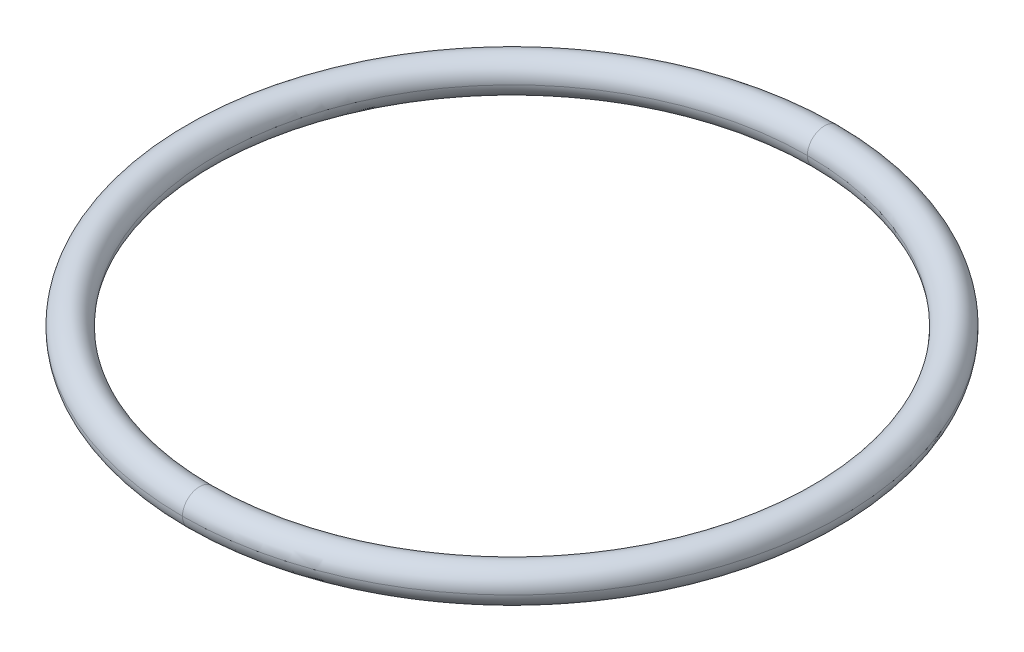
ISO-10303-21;
HEADER;
FILE_DESCRIPTION(('STEP AP214'),'2;1');
FILE_NAME('part.step','',(''),(''),'','','');
FILE_SCHEMA(('AUTOMOTIVE_DESIGN { 1 0 10303 214 1 1 1 1 }'));
ENDSEC;
DATA;
#1=APPLICATION_CONTEXT('core data for automotive mechanical design processes');
#2=APPLICATION_PROTOCOL_DEFINITION('international standard','automotive_design',2000,#1);
#3=PRODUCT_CONTEXT('',#1,'mechanical');
#4=PRODUCT('Part','Part','',(#3));
#5=PRODUCT_RELATED_PRODUCT_CATEGORY('part','',(#4));
#6=PRODUCT_DEFINITION_FORMATION('','',#4);
#7=PRODUCT_DEFINITION_CONTEXT('part definition',#1,'design');
#8=PRODUCT_DEFINITION('design','',#6,#7);
#9=PRODUCT_DEFINITION_SHAPE('','',#8);
#10=(LENGTH_UNIT() NAMED_UNIT(*) SI_UNIT(.MILLI.,.METRE.));
#11=(NAMED_UNIT(*) PLANE_ANGLE_UNIT() SI_UNIT($,.RADIAN.));
#12=(NAMED_UNIT(*) SI_UNIT($,.STERADIAN.) SOLID_ANGLE_UNIT());
#13=UNCERTAINTY_MEASURE_WITH_UNIT(LENGTH_MEASURE(1.E-05),#10,'distance_accuracy_value','');
#14=(GEOMETRIC_REPRESENTATION_CONTEXT(3) GLOBAL_UNCERTAINTY_ASSIGNED_CONTEXT((#13)) GLOBAL_UNIT_ASSIGNED_CONTEXT((#10,
#11,#12)) REPRESENTATION_CONTEXT('',''));
#15=CARTESIAN_POINT('',(0.,0.,0.));
#16=DIRECTION('',(0.,0.,1.));
#17=DIRECTION('',(1.,0.,0.));
#18=AXIS2_PLACEMENT_3D('',#15,#16,#17);
#19=CARTESIAN_POINT('',(0.,0.,0.));
#20=DIRECTION('',(0.,-1.,0.));
#21=DIRECTION('',(0.,0.,-1.));
#22=AXIS2_PLACEMENT_3D('',#19,#20,#21);
#23=TOROIDAL_SURFACE('',#22,17.35,0.95);
#24=CARTESIAN_POINT('',(0.,0.,0.));
#25=DIRECTION('',(0.,-1.,0.));
#26=DIRECTION('',(0.,0.,-1.));
#27=AXIS2_PLACEMENT_3D('',#24,#25,#26);
#28=CIRCLE('',#27,18.3);
#29=CARTESIAN_POINT('',(0.,0.,18.3));
#30=VERTEX_POINT('',#29);
#31=CARTESIAN_POINT('',(0.,0.,-18.3));
#32=VERTEX_POINT('',#31);
#33=EDGE_CURVE('E71',#30,#32,#28,.T.);
#34=ORIENTED_EDGE('',*,*,#33,.F.);
#35=CARTESIAN_POINT('',(0.,0.,17.35));
#36=DIRECTION('',(1.,0.,0.));
#37=DIRECTION('',(0.,0.,-1.));
#38=AXIS2_PLACEMENT_3D('',#35,#36,#37);
#39=CIRCLE('',#38,0.95);
#40=CARTESIAN_POINT('',(0.,0.,16.4));
#41=VERTEX_POINT('',#40);
#42=EDGE_CURVE('E11',#41,#30,#39,.T.);
#43=ORIENTED_EDGE('',*,*,#42,.F.);
#44=CARTESIAN_POINT('',(0.,0.,0.));
#45=DIRECTION('',(0.,-1.,0.));
#46=DIRECTION('',(0.,0.,-1.));
#47=AXIS2_PLACEMENT_3D('',#44,#45,#46);
#48=CIRCLE('',#47,16.4);
#49=CARTESIAN_POINT('',(0.,0.,-16.4));
#50=VERTEX_POINT('',#49);
#51=EDGE_CURVE('E20',#41,#50,#48,.T.);
#52=ORIENTED_EDGE('',*,*,#51,.T.);
#53=CARTESIAN_POINT('',(0.,0.,-17.35));
#54=DIRECTION('',(-1.,0.,0.));
#55=DIRECTION('',(0.,0.,1.));
#56=AXIS2_PLACEMENT_3D('',#53,#54,#55);
#57=CIRCLE('',#56,0.95);
#58=EDGE_CURVE('E27',#50,#32,#57,.T.);
#59=ORIENTED_EDGE('',*,*,#58,.T.);
#60=EDGE_LOOP('',(#34,#43,#52,#59));
#61=FACE_BOUND('',#60,.T.);
#62=ADVANCED_FACE('F16',(#61),#23,.T.);
#63=CARTESIAN_POINT('',(0.,0.,0.));
#64=DIRECTION('',(0.,-1.,0.));
#65=DIRECTION('',(0.,0.,-1.));
#66=AXIS2_PLACEMENT_3D('',#63,#64,#65);
#67=TOROIDAL_SURFACE('',#66,17.35,0.95);
#68=CARTESIAN_POINT('',(0.,0.,0.));
#69=DIRECTION('',(0.,-1.,0.));
#70=DIRECTION('',(0.,0.,-1.));
#71=AXIS2_PLACEMENT_3D('',#68,#69,#70);
#72=CIRCLE('',#71,18.3);
#73=EDGE_CURVE('E57',#32,#30,#72,.T.);
#74=ORIENTED_EDGE('',*,*,#73,.F.);
#75=ORIENTED_EDGE('',*,*,#58,.F.);
#76=CARTESIAN_POINT('',(0.,0.,0.));
#77=DIRECTION('',(0.,-1.,0.));
#78=DIRECTION('',(0.,0.,-1.));
#79=AXIS2_PLACEMENT_3D('',#76,#77,#78);
#80=CIRCLE('',#79,16.4);
#81=EDGE_CURVE('E59',#50,#41,#80,.T.);
#82=ORIENTED_EDGE('',*,*,#81,.T.);
#83=ORIENTED_EDGE('',*,*,#42,.T.);
#84=EDGE_LOOP('',(#74,#75,#82,#83));
#85=FACE_BOUND('',#84,.T.);
#86=ADVANCED_FACE('F56',(#85),#67,.T.);
#87=CARTESIAN_POINT('',(0.,0.,0.));
#88=DIRECTION('',(0.,-1.,0.));
#89=DIRECTION('',(0.,0.,-1.));
#90=AXIS2_PLACEMENT_3D('',#87,#88,#89);
#91=TOROIDAL_SURFACE('',#90,17.35,0.95);
#92=CARTESIAN_POINT('',(0.,0.,-17.35));
#93=DIRECTION('',(-1.,0.,0.));
#94=DIRECTION('',(0.,0.,1.));
#95=AXIS2_PLACEMENT_3D('',#92,#93,#94);
#96=CIRCLE('',#95,0.95);
#97=EDGE_CURVE('E67',#32,#50,#96,.T.);
#98=ORIENTED_EDGE('',*,*,#97,.F.);
#99=ORIENTED_EDGE('',*,*,#73,.T.);
#100=CARTESIAN_POINT('',(0.,0.,17.35));
#101=DIRECTION('',(1.,0.,0.));
#102=DIRECTION('',(0.,0.,-1.));
#103=AXIS2_PLACEMENT_3D('',#100,#101,#102);
#104=CIRCLE('',#103,0.95);
#105=EDGE_CURVE('E65',#30,#41,#104,.T.);
#106=ORIENTED_EDGE('',*,*,#105,.T.);
#107=ORIENTED_EDGE('',*,*,#81,.F.);
#108=EDGE_LOOP('',(#98,#99,#106,#107));
#109=FACE_BOUND('',#108,.T.);
#110=ADVANCED_FACE('F63',(#109),#91,.T.);
#111=CARTESIAN_POINT('',(0.,0.,0.));
#112=DIRECTION('',(0.,-1.,0.));
#113=DIRECTION('',(0.,0.,-1.));
#114=AXIS2_PLACEMENT_3D('',#111,#112,#113);
#115=TOROIDAL_SURFACE('',#114,17.35,0.95);
#116=ORIENTED_EDGE('',*,*,#105,.F.);
#117=ORIENTED_EDGE('',*,*,#33,.T.);
#118=ORIENTED_EDGE('',*,*,#97,.T.);
#119=ORIENTED_EDGE('',*,*,#51,.F.);
#120=EDGE_LOOP('',(#116,#117,#118,#119));
#121=FACE_BOUND('',#120,.T.);
#122=ADVANCED_FACE('F18',(#121),#115,.T.);
#123=CLOSED_SHELL('',(#62,#86,#110,#122));
#124=MANIFOLD_SOLID_BREP('B1',#123);
#125=ADVANCED_BREP_SHAPE_REPRESENTATION('',(#18,#124),#14);
#126=SHAPE_DEFINITION_REPRESENTATION(#9,#125);
ENDSEC;
END-ISO-10303-21;
